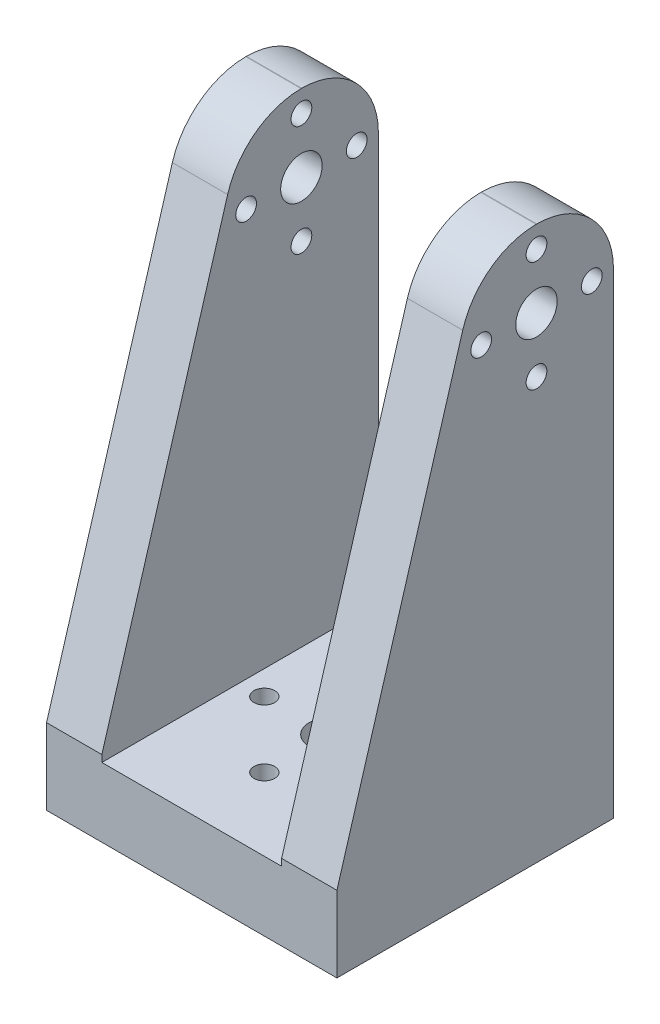
ISO-10303-21;
HEADER;
FILE_DESCRIPTION(('STEP AP214'),'2;1');
FILE_NAME('part.step','',(''),(''),'','','');
FILE_SCHEMA(('AUTOMOTIVE_DESIGN { 1 0 10303 214 1 1 1 1 }'));
ENDSEC;
DATA;
#1=APPLICATION_CONTEXT('core data for automotive mechanical design processes');
#2=APPLICATION_PROTOCOL_DEFINITION('international standard','automotive_design',2000,#1);
#3=PRODUCT_CONTEXT('',#1,'mechanical');
#4=PRODUCT('Part','Part','',(#3));
#5=PRODUCT_RELATED_PRODUCT_CATEGORY('part','',(#4));
#6=PRODUCT_DEFINITION_FORMATION('','',#4);
#7=PRODUCT_DEFINITION_CONTEXT('part definition',#1,'design');
#8=PRODUCT_DEFINITION('design','',#6,#7);
#9=PRODUCT_DEFINITION_SHAPE('','',#8);
#10=(LENGTH_UNIT() NAMED_UNIT(*) SI_UNIT(.MILLI.,.METRE.));
#11=(NAMED_UNIT(*) PLANE_ANGLE_UNIT() SI_UNIT($,.RADIAN.));
#12=(NAMED_UNIT(*) SI_UNIT($,.STERADIAN.) SOLID_ANGLE_UNIT());
#13=UNCERTAINTY_MEASURE_WITH_UNIT(LENGTH_MEASURE(1.E-05),#10,'distance_accuracy_value','');
#14=(GEOMETRIC_REPRESENTATION_CONTEXT(3) GLOBAL_UNCERTAINTY_ASSIGNED_CONTEXT((#13)) GLOBAL_UNIT_ASSIGNED_CONTEXT((#10,
#11,#12)) REPRESENTATION_CONTEXT('',''));
#15=CARTESIAN_POINT('',(0.,0.,0.));
#16=DIRECTION('',(0.,0.,1.));
#17=DIRECTION('',(1.,0.,0.));
#18=AXIS2_PLACEMENT_3D('',#15,#16,#17);
#19=CARTESIAN_POINT('',(-13.,10.,40.));
#20=DIRECTION('',(-1.,0.,0.));
#21=DIRECTION('',(0.,-1.,0.));
#22=AXIS2_PLACEMENT_3D('',#19,#20,#21);
#23=PLANE('',#22);
#24=CARTESIAN_POINT('',(-13.,76.8660020905922,11.1344946143605));
#25=DIRECTION('',(-1.,0.,0.));
#26=DIRECTION('',(0.,-1.,0.));
#27=AXIS2_PLACEMENT_3D('',#24,#25,#26);
#28=CIRCLE('',#27,1.50000000000001);
#29=CARTESIAN_POINT('',(-13.,75.3660020905922,11.1344946143605));
#30=VERTEX_POINT('',#29);
#31=EDGE_CURVE('E331',#30,#30,#28,.T.);
#32=ORIENTED_EDGE('',*,*,#31,.T.);
#33=EDGE_LOOP('',(#32));
#34=FACE_BOUND('',#33,.T.);
#35=CARTESIAN_POINT('',(-13.,68.8660020905922,19.1344946143605));
#36=DIRECTION('',(-1.,0.,0.));
#37=DIRECTION('',(0.,-1.,0.));
#38=AXIS2_PLACEMENT_3D('',#35,#36,#37);
#39=CIRCLE('',#38,1.5);
#40=CARTESIAN_POINT('',(-13.,67.3660020905922,19.1344946143605));
#41=VERTEX_POINT('',#40);
#42=EDGE_CURVE('E318',#41,#41,#39,.T.);
#43=ORIENTED_EDGE('',*,*,#42,.T.);
#44=EDGE_LOOP('',(#43));
#45=FACE_BOUND('',#44,.T.);
#46=CARTESIAN_POINT('',(-13.,60.8660020905922,11.1344946143604));
#47=DIRECTION('',(-1.,0.,0.));
#48=DIRECTION('',(0.,-1.,0.));
#49=AXIS2_PLACEMENT_3D('',#46,#47,#48);
#50=CIRCLE('',#49,1.5);
#51=CARTESIAN_POINT('',(-13.,59.3660020905922,11.1344946143604));
#52=VERTEX_POINT('',#51);
#53=EDGE_CURVE('E314',#52,#52,#50,.T.);
#54=ORIENTED_EDGE('',*,*,#53,.T.);
#55=EDGE_LOOP('',(#54));
#56=FACE_BOUND('',#55,.T.);
#57=CARTESIAN_POINT('',(-13.,68.8660020905922,3.13449461436051));
#58=DIRECTION('',(-1.,0.,0.));
#59=DIRECTION('',(0.,-1.,0.));
#60=AXIS2_PLACEMENT_3D('',#57,#58,#59);
#61=CIRCLE('',#60,1.5);
#62=CARTESIAN_POINT('',(-13.,67.3660020905922,3.13449461436051));
#63=VERTEX_POINT('',#62);
#64=EDGE_CURVE('E310',#63,#63,#61,.T.);
#65=ORIENTED_EDGE('',*,*,#64,.T.);
#66=EDGE_LOOP('',(#65));
#67=FACE_BOUND('',#66,.T.);
#68=CARTESIAN_POINT('',(-13.,68.8660020905922,11.1344946143605));
#69=DIRECTION('',(-1.,0.,0.));
#70=DIRECTION('',(0.,-1.,0.));
#71=AXIS2_PLACEMENT_3D('',#68,#69,#70);
#72=CIRCLE('',#71,3.);
#73=CARTESIAN_POINT('',(-13.,65.8660020905922,11.1344946143605));
#74=VERTEX_POINT('',#73);
#75=EDGE_CURVE('E218',#74,#74,#72,.T.);
#76=ORIENTED_EDGE('',*,*,#75,.T.);
#77=EDGE_LOOP('',(#76));
#78=FACE_BOUND('',#77,.T.);
#79=CARTESIAN_POINT('',(-13.,68.8660020905922,11.1344946143605));
#80=DIRECTION('',(-1.,0.,0.));
#81=DIRECTION('',(0.,-1.,0.));
#82=AXIS2_PLACEMENT_3D('',#79,#80,#81);
#83=CIRCLE('',#82,11.1341050492668);
#84=CARTESIAN_POINT('',(-13.,80.,11.0856499482089));
#85=VERTEX_POINT('',#84);
#86=CARTESIAN_POINT('',(-13.,68.8660020905922,0.000389565093718291));
#87=VERTEX_POINT('',#86);
#88=EDGE_CURVE('E183',#85,#87,#83,.T.);
#89=ORIENTED_EDGE('',*,*,#88,.F.);
#90=DIRECTION('',(0.,0.,-1.));
#91=VECTOR('',#90,1.);
#92=CARTESIAN_POINT('',(-13.,80.,40.));
#93=LINE('',#92,#91);
#94=CARTESIAN_POINT('',(-13.,80.,11.1833392805122));
#95=VERTEX_POINT('',#94);
#96=EDGE_CURVE('E297',#95,#85,#93,.T.);
#97=ORIENTED_EDGE('',*,*,#96,.F.);
#98=CARTESIAN_POINT('',(-13.,68.8660020905922,11.1344946143605));
#99=DIRECTION('',(-1.,0.,0.));
#100=DIRECTION('',(0.,-1.,0.));
#101=AXIS2_PLACEMENT_3D('',#98,#99,#100);
#102=CIRCLE('',#101,11.1341050492668);
#103=CARTESIAN_POINT('',(-13.,72.0457089092662,21.8049097794507));
#104=VERTEX_POINT('',#103);
#105=EDGE_CURVE('E248',#104,#95,#102,.T.);
#106=ORIENTED_EDGE('',*,*,#105,.F.);
#107=DIRECTION('',(0.,-0.958354094727429,0.285582613474929));
#108=VECTOR('',#107,1.);
#109=CARTESIAN_POINT('',(-13.,10.080487600934,40.2700991527157));
#110=LINE('',#109,#108);
#111=CARTESIAN_POINT('',(-13.,10.9868825170594,40.));
#112=VERTEX_POINT('',#111);
#113=EDGE_CURVE('E245',#104,#112,#110,.T.);
#114=ORIENTED_EDGE('',*,*,#113,.T.);
#115=DIRECTION('',(0.,1.,0.));
#116=VECTOR('',#115,1.);
#117=CARTESIAN_POINT('',(-13.,10.,40.));
#118=LINE('',#117,#116);
#119=CARTESIAN_POINT('',(-13.,10.,40.));
#120=VERTEX_POINT('',#119);
#121=EDGE_CURVE('E251',#120,#112,#118,.T.);
#122=ORIENTED_EDGE('',*,*,#121,.F.);
#123=DIRECTION('',(0.,0.,-1.));
#124=VECTOR('',#123,1.);
#125=CARTESIAN_POINT('',(-13.,10.,40.));
#126=LINE('',#125,#124);
#127=CARTESIAN_POINT('',(-13.,10.,0.));
#128=VERTEX_POINT('',#127);
#129=EDGE_CURVE('E266',#120,#128,#126,.T.);
#130=ORIENTED_EDGE('',*,*,#129,.T.);
#131=DIRECTION('',(0.,1.,0.));
#132=VECTOR('',#131,1.);
#133=CARTESIAN_POINT('',(-13.,10.,0.));
#134=LINE('',#133,#132);
#135=CARTESIAN_POINT('',(-13.,10.9868825170594,0.));
#136=VERTEX_POINT('',#135);
#137=EDGE_CURVE('E250',#128,#136,#134,.T.);
#138=ORIENTED_EDGE('',*,*,#137,.T.);
#139=DIRECTION('',(0.,0.999999999977349,6.73066723509058E-06));
#140=VECTOR('',#139,1.);
#141=CARTESIAN_POINT('',(-13.,10.0002692267341,-6.64056575006011E-06));
#142=LINE('',#141,#140);
#143=EDGE_CURVE('E88',#136,#87,#142,.T.);
#144=ORIENTED_EDGE('',*,*,#143,.T.);
#145=EDGE_LOOP('',(#89,#97,#106,#114,#122,#130,#138,#144));
#146=FACE_BOUND('',#145,.T.);
#147=ADVANCED_FACE('F64',(#34,#45,#56,#67,#78,#146),#23,.F.);
#148=CARTESIAN_POINT('',(-13.,80.,40.));
#149=DIRECTION('',(0.,-1.,0.));
#150=DIRECTION('',(0.,0.,-1.));
#151=AXIS2_PLACEMENT_3D('',#148,#149,#150);
#152=PLANE('',#151);
#153=DIRECTION('',(1.,0.,0.));
#154=VECTOR('',#153,1.);
#155=CARTESIAN_POINT('',(-21.,80.,11.0856499482089));
#156=LINE('',#155,#154);
#157=CARTESIAN_POINT('',(-21.,80.,11.0856499482089));
#158=VERTEX_POINT('',#157);
#159=EDGE_CURVE('E208',#158,#85,#156,.T.);
#160=ORIENTED_EDGE('',*,*,#159,.F.);
#161=DIRECTION('',(0.,0.,-1.));
#162=VECTOR('',#161,1.);
#163=CARTESIAN_POINT('',(-21.,80.,40.));
#164=LINE('',#163,#162);
#165=CARTESIAN_POINT('',(-21.,80.,11.1833392805122));
#166=VERTEX_POINT('',#165);
#167=EDGE_CURVE('E197',#166,#158,#164,.T.);
#168=ORIENTED_EDGE('',*,*,#167,.F.);
#169=DIRECTION('',(1.,0.,0.));
#170=VECTOR('',#169,1.);
#171=CARTESIAN_POINT('',(-21.,80.,11.1833392805122));
#172=LINE('',#171,#170);
#173=EDGE_CURVE('E240',#166,#95,#172,.T.);
#174=ORIENTED_EDGE('',*,*,#173,.T.);
#175=ORIENTED_EDGE('',*,*,#96,.T.);
#176=EDGE_LOOP('',(#160,#168,#174,#175));
#177=FACE_BOUND('',#176,.T.);
#178=ADVANCED_FACE('F431',(#177),#152,.F.);
#179=CARTESIAN_POINT('',(-21.,80.,40.));
#180=DIRECTION('',(1.,0.,0.));
#181=DIRECTION('',(0.,0.,-1.));
#182=AXIS2_PLACEMENT_3D('',#179,#180,#181);
#183=PLANE('',#182);
#184=CARTESIAN_POINT('',(-21.,76.8660020905922,11.1344946143605));
#185=DIRECTION('',(-1.,0.,0.));
#186=DIRECTION('',(0.,0.,1.));
#187=AXIS2_PLACEMENT_3D('',#184,#185,#186);
#188=CIRCLE('',#187,1.50000000000001);
#189=CARTESIAN_POINT('',(-21.,76.8660020905922,12.6344946143605));
#190=VERTEX_POINT('',#189);
#191=EDGE_CURVE('E481',#190,#190,#188,.T.);
#192=ORIENTED_EDGE('',*,*,#191,.F.);
#193=EDGE_LOOP('',(#192));
#194=FACE_BOUND('',#193,.T.);
#195=CARTESIAN_POINT('',(-21.,68.8660020905922,19.1344946143605));
#196=DIRECTION('',(-1.,0.,0.));
#197=DIRECTION('',(0.,0.,1.));
#198=AXIS2_PLACEMENT_3D('',#195,#196,#197);
#199=CIRCLE('',#198,1.5);
#200=CARTESIAN_POINT('',(-21.,68.8660020905922,20.6344946143605));
#201=VERTEX_POINT('',#200);
#202=EDGE_CURVE('E485',#201,#201,#199,.T.);
#203=ORIENTED_EDGE('',*,*,#202,.F.);
#204=EDGE_LOOP('',(#203));
#205=FACE_BOUND('',#204,.T.);
#206=CARTESIAN_POINT('',(-21.,60.8660020905922,11.1344946143604));
#207=DIRECTION('',(-1.,0.,0.));
#208=DIRECTION('',(0.,0.,1.));
#209=AXIS2_PLACEMENT_3D('',#206,#207,#208);
#210=CIRCLE('',#209,1.5);
#211=CARTESIAN_POINT('',(-21.,60.8660020905922,12.6344946143604));
#212=VERTEX_POINT('',#211);
#213=EDGE_CURVE('E328',#212,#212,#210,.T.);
#214=ORIENTED_EDGE('',*,*,#213,.F.);
#215=EDGE_LOOP('',(#214));
#216=FACE_BOUND('',#215,.T.);
#217=CARTESIAN_POINT('',(-21.,68.8660020905922,3.13449461436051));
#218=DIRECTION('',(-1.,0.,0.));
#219=DIRECTION('',(0.,0.,1.));
#220=AXIS2_PLACEMENT_3D('',#217,#218,#219);
#221=CIRCLE('',#220,1.5);
#222=CARTESIAN_POINT('',(-21.,68.8660020905922,4.63449461436051));
#223=VERTEX_POINT('',#222);
#224=EDGE_CURVE('E334',#223,#223,#221,.T.);
#225=ORIENTED_EDGE('',*,*,#224,.F.);
#226=EDGE_LOOP('',(#225));
#227=FACE_BOUND('',#226,.T.);
#228=CARTESIAN_POINT('',(-21.,68.8660020905922,11.1344946143605));
#229=DIRECTION('',(1.,0.,0.));
#230=DIRECTION('',(0.,0.,-1.));
#231=AXIS2_PLACEMENT_3D('',#228,#229,#230);
#232=CIRCLE('',#231,3.);
#233=CARTESIAN_POINT('',(-21.,68.8660020905922,8.13449461436051));
#234=VERTEX_POINT('',#233);
#235=EDGE_CURVE('E206',#234,#234,#232,.T.);
#236=ORIENTED_EDGE('',*,*,#235,.T.);
#237=EDGE_LOOP('',(#236));
#238=FACE_BOUND('',#237,.T.);
#239=CARTESIAN_POINT('',(-21.,68.8660020905922,11.1344946143605));
#240=DIRECTION('',(1.,0.,0.));
#241=DIRECTION('',(0.,0.,-1.));
#242=AXIS2_PLACEMENT_3D('',#239,#240,#241);
#243=CIRCLE('',#242,11.1341050492668);
#244=CARTESIAN_POINT('',(-21.,68.8660020905922,0.000389565093718291));
#245=VERTEX_POINT('',#244);
#246=EDGE_CURVE('E180',#245,#158,#243,.T.);
#247=ORIENTED_EDGE('',*,*,#246,.F.);
#248=DIRECTION('',(0.,-0.999999999977349,-6.73066723509058E-06));
#249=VECTOR('',#248,1.);
#250=CARTESIAN_POINT('',(-21.,4.9772644906791E-10,-7.3949050171686E-05));
#251=LINE('',#250,#249);
#252=CARTESIAN_POINT('',(-21.,10.9868825170594,0.));
#253=VERTEX_POINT('',#252);
#254=EDGE_CURVE('E188',#245,#253,#251,.T.);
#255=ORIENTED_EDGE('',*,*,#254,.T.);
#256=DIRECTION('',(0.,-1.,0.));
#257=VECTOR('',#256,1.);
#258=CARTESIAN_POINT('',(-21.,80.,0.));
#259=LINE('',#258,#257);
#260=CARTESIAN_POINT('',(-21.,0.,0.));
#261=VERTEX_POINT('',#260);
#262=EDGE_CURVE('E269',#253,#261,#259,.T.);
#263=ORIENTED_EDGE('',*,*,#262,.T.);
#264=DIRECTION('',(0.,0.,-1.));
#265=VECTOR('',#264,1.);
#266=CARTESIAN_POINT('',(-21.,0.,40.));
#267=LINE('',#266,#265);
#268=CARTESIAN_POINT('',(-21.,0.,40.));
#269=VERTEX_POINT('',#268);
#270=EDGE_CURVE('E293',#269,#261,#267,.T.);
#271=ORIENTED_EDGE('',*,*,#270,.F.);
#272=DIRECTION('',(0.,-1.,0.));
#273=VECTOR('',#272,1.);
#274=CARTESIAN_POINT('',(-21.,80.,40.));
#275=LINE('',#274,#273);
#276=CARTESIAN_POINT('',(-21.,10.9868825170594,40.));
#277=VERTEX_POINT('',#276);
#278=EDGE_CURVE('E254',#277,#269,#275,.T.);
#279=ORIENTED_EDGE('',*,*,#278,.F.);
#280=DIRECTION('',(0.,0.958354094727429,-0.285582613474929));
#281=VECTOR('',#280,1.);
#282=CARTESIAN_POINT('',(-21.,11.8436325723921,39.7446946580154));
#283=LINE('',#282,#281);
#284=CARTESIAN_POINT('',(-21.,72.0457089092662,21.8049097794507));
#285=VERTEX_POINT('',#284);
#286=EDGE_CURVE('E224',#277,#285,#283,.T.);
#287=ORIENTED_EDGE('',*,*,#286,.T.);
#288=CARTESIAN_POINT('',(-21.,68.8660020905922,11.1344946143605));
#289=DIRECTION('',(1.,0.,0.));
#290=DIRECTION('',(0.,0.,-1.));
#291=AXIS2_PLACEMENT_3D('',#288,#289,#290);
#292=CIRCLE('',#291,11.1341050492668);
#293=EDGE_CURVE('E222',#166,#285,#292,.T.);
#294=ORIENTED_EDGE('',*,*,#293,.F.);
#295=ORIENTED_EDGE('',*,*,#167,.T.);
#296=EDGE_LOOP('',(#247,#255,#263,#271,#279,#287,#294,#295));
#297=FACE_BOUND('',#296,.T.);
#298=ADVANCED_FACE('F194',(#194,#205,#216,#227,#238,#297),#183,.F.);
#299=CARTESIAN_POINT('',(21.,80.,40.));
#300=DIRECTION('',(-1.,0.,0.));
#301=DIRECTION('',(0.,0.,1.));
#302=AXIS2_PLACEMENT_3D('',#299,#300,#301);
#303=PLANE('',#302);
#304=CARTESIAN_POINT('',(21.,76.8660020905922,11.1344946143605));
#305=DIRECTION('',(-1.,0.,0.));
#306=DIRECTION('',(0.,0.,1.));
#307=AXIS2_PLACEMENT_3D('',#304,#305,#306);
#308=CIRCLE('',#307,1.50000000000001);
#309=CARTESIAN_POINT('',(21.,76.8660020905922,12.6344946143605));
#310=VERTEX_POINT('',#309);
#311=EDGE_CURVE('E315',#310,#310,#308,.T.);
#312=ORIENTED_EDGE('',*,*,#311,.T.);
#313=EDGE_LOOP('',(#312));
#314=FACE_BOUND('',#313,.T.);
#315=CARTESIAN_POINT('',(21.,68.8660020905922,19.1344946143605));
#316=DIRECTION('',(-1.,0.,0.));
#317=DIRECTION('',(0.,0.,1.));
#318=AXIS2_PLACEMENT_3D('',#315,#316,#317);
#319=CIRCLE('',#318,1.5);
#320=CARTESIAN_POINT('',(21.,68.8660020905922,20.6344946143605));
#321=VERTEX_POINT('',#320);
#322=EDGE_CURVE('E629',#321,#321,#319,.T.);
#323=ORIENTED_EDGE('',*,*,#322,.T.);
#324=EDGE_LOOP('',(#323));
#325=FACE_BOUND('',#324,.T.);
#326=CARTESIAN_POINT('',(21.,60.8660020905922,11.1344946143604));
#327=DIRECTION('',(-1.,0.,0.));
#328=DIRECTION('',(0.,0.,1.));
#329=AXIS2_PLACEMENT_3D('',#326,#327,#328);
#330=CIRCLE('',#329,1.5);
#331=CARTESIAN_POINT('',(21.,60.8660020905922,12.6344946143604));
#332=VERTEX_POINT('',#331);
#333=EDGE_CURVE('E636',#332,#332,#330,.T.);
#334=ORIENTED_EDGE('',*,*,#333,.T.);
#335=EDGE_LOOP('',(#334));
#336=FACE_BOUND('',#335,.T.);
#337=CARTESIAN_POINT('',(21.,68.8660020905922,3.13449461436051));
#338=DIRECTION('',(-1.,0.,0.));
#339=DIRECTION('',(0.,0.,1.));
#340=AXIS2_PLACEMENT_3D('',#337,#338,#339);
#341=CIRCLE('',#340,1.5);
#342=CARTESIAN_POINT('',(21.,68.8660020905922,4.63449461436051));
#343=VERTEX_POINT('',#342);
#344=EDGE_CURVE('E311',#343,#343,#341,.T.);
#345=ORIENTED_EDGE('',*,*,#344,.T.);
#346=EDGE_LOOP('',(#345));
#347=FACE_BOUND('',#346,.T.);
#348=CARTESIAN_POINT('',(21.,68.8660020905922,11.1344946143605));
#349=DIRECTION('',(1.,0.,0.));
#350=DIRECTION('',(0.,0.,-1.));
#351=AXIS2_PLACEMENT_3D('',#348,#349,#350);
#352=CIRCLE('',#351,3.);
#353=CARTESIAN_POINT('',(21.,68.8660020905922,8.13449461436051));
#354=VERTEX_POINT('',#353);
#355=EDGE_CURVE('E202',#354,#354,#352,.T.);
#356=ORIENTED_EDGE('',*,*,#355,.F.);
#357=EDGE_LOOP('',(#356));
#358=FACE_BOUND('',#357,.T.);
#359=CARTESIAN_POINT('',(21.,68.8660020905922,11.1344946143605));
#360=DIRECTION('',(1.,0.,0.));
#361=DIRECTION('',(0.,0.,-1.));
#362=AXIS2_PLACEMENT_3D('',#359,#360,#361);
#363=CIRCLE('',#362,11.1341050492668);
#364=CARTESIAN_POINT('',(21.,68.8660020905922,0.000389565093718291));
#365=VERTEX_POINT('',#364);
#366=CARTESIAN_POINT('',(21.,80.,11.0856499482089));
#367=VERTEX_POINT('',#366);
#368=EDGE_CURVE('E199',#365,#367,#363,.T.);
#369=ORIENTED_EDGE('',*,*,#368,.T.);
#370=DIRECTION('',(0.,0.,-1.));
#371=VECTOR('',#370,1.);
#372=CARTESIAN_POINT('',(21.,80.,40.));
#373=LINE('',#372,#371);
#374=CARTESIAN_POINT('',(21.,80.,11.1833392805122));
#375=VERTEX_POINT('',#374);
#376=EDGE_CURVE('E287',#375,#367,#373,.T.);
#377=ORIENTED_EDGE('',*,*,#376,.F.);
#378=CARTESIAN_POINT('',(21.,68.8660020905922,11.1344946143605));
#379=DIRECTION('',(1.,0.,0.));
#380=DIRECTION('',(0.,0.,-1.));
#381=AXIS2_PLACEMENT_3D('',#378,#379,#380);
#382=CIRCLE('',#381,11.1341050492668);
#383=CARTESIAN_POINT('',(21.,72.0457089092662,21.8049097794507));
#384=VERTEX_POINT('',#383);
#385=EDGE_CURVE('E221',#375,#384,#382,.T.);
#386=ORIENTED_EDGE('',*,*,#385,.T.);
#387=DIRECTION('',(0.,0.958354094727429,-0.285582613474929));
#388=VECTOR('',#387,1.);
#389=CARTESIAN_POINT('',(21.,11.8436325723921,39.7446946580154));
#390=LINE('',#389,#388);
#391=CARTESIAN_POINT('',(21.,10.9868825170594,40.));
#392=VERTEX_POINT('',#391);
#393=EDGE_CURVE('E225',#392,#384,#390,.T.);
#394=ORIENTED_EDGE('',*,*,#393,.F.);
#395=DIRECTION('',(0.,1.,0.));
#396=VECTOR('',#395,1.);
#397=CARTESIAN_POINT('',(21.,80.,40.));
#398=LINE('',#397,#396);
#399=CARTESIAN_POINT('',(21.,0.,40.));
#400=VERTEX_POINT('',#399);
#401=EDGE_CURVE('E259',#400,#392,#398,.T.);
#402=ORIENTED_EDGE('',*,*,#401,.F.);
#403=DIRECTION('',(0.,0.,-1.));
#404=VECTOR('',#403,1.);
#405=CARTESIAN_POINT('',(21.,0.,40.));
#406=LINE('',#405,#404);
#407=CARTESIAN_POINT('',(21.,0.,0.));
#408=VERTEX_POINT('',#407);
#409=EDGE_CURVE('E290',#400,#408,#406,.T.);
#410=ORIENTED_EDGE('',*,*,#409,.T.);
#411=DIRECTION('',(0.,1.,0.));
#412=VECTOR('',#411,1.);
#413=CARTESIAN_POINT('',(21.,80.,0.));
#414=LINE('',#413,#412);
#415=CARTESIAN_POINT('',(21.,10.9868825170594,0.));
#416=VERTEX_POINT('',#415);
#417=EDGE_CURVE('E273',#408,#416,#414,.T.);
#418=ORIENTED_EDGE('',*,*,#417,.T.);
#419=DIRECTION('',(0.,-0.999999999977349,-6.73066723509058E-06));
#420=VECTOR('',#419,1.);
#421=CARTESIAN_POINT('',(21.,4.9772644906791E-10,-7.3949050171686E-05));
#422=LINE('',#421,#420);
#423=EDGE_CURVE('E80',#365,#416,#422,.T.);
#424=ORIENTED_EDGE('',*,*,#423,.F.);
#425=EDGE_LOOP('',(#369,#377,#386,#394,#402,#410,#418,#424));
#426=FACE_BOUND('',#425,.T.);
#427=ADVANCED_FACE('F379',(#314,#325,#336,#347,#358,#426),#303,.F.);
#428=CARTESIAN_POINT('',(13.,80.,40.));
#429=DIRECTION('',(0.,-1.,0.));
#430=DIRECTION('',(0.,0.,-1.));
#431=AXIS2_PLACEMENT_3D('',#428,#429,#430);
#432=PLANE('',#431);
#433=CARTESIAN_POINT('',(13.,80.,11.0856499482089));
#434=VERTEX_POINT('',#433);
#435=EDGE_CURVE('E211',#434,#367,#156,.T.);
#436=ORIENTED_EDGE('',*,*,#435,.F.);
#437=DIRECTION('',(0.,0.,-1.));
#438=VECTOR('',#437,1.);
#439=CARTESIAN_POINT('',(13.,80.,40.));
#440=LINE('',#439,#438);
#441=CARTESIAN_POINT('',(13.,80.,11.1833392805122));
#442=VERTEX_POINT('',#441);
#443=EDGE_CURVE('E284',#442,#434,#440,.T.);
#444=ORIENTED_EDGE('',*,*,#443,.F.);
#445=EDGE_CURVE('E228',#442,#375,#172,.T.);
#446=ORIENTED_EDGE('',*,*,#445,.T.);
#447=ORIENTED_EDGE('',*,*,#376,.T.);
#448=EDGE_LOOP('',(#436,#444,#446,#447));
#449=FACE_BOUND('',#448,.T.);
#450=ADVANCED_FACE('F382',(#449),#432,.F.);
#451=CARTESIAN_POINT('',(13.,10.,40.));
#452=DIRECTION('',(1.,0.,0.));
#453=DIRECTION('',(0.,1.,0.));
#454=AXIS2_PLACEMENT_3D('',#451,#452,#453);
#455=PLANE('',#454);
#456=CARTESIAN_POINT('',(13.,76.8660020905922,11.1344946143605));
#457=DIRECTION('',(1.,0.,0.));
#458=DIRECTION('',(0.,1.,0.));
#459=AXIS2_PLACEMENT_3D('',#456,#457,#458);
#460=CIRCLE('',#459,1.50000000000001);
#461=CARTESIAN_POINT('',(13.,78.3660020905923,11.1344946143605));
#462=VERTEX_POINT('',#461);
#463=EDGE_CURVE('E67',#462,#462,#460,.T.);
#464=ORIENTED_EDGE('',*,*,#463,.T.);
#465=EDGE_LOOP('',(#464));
#466=FACE_BOUND('',#465,.T.);
#467=CARTESIAN_POINT('',(13.,68.8660020905922,19.1344946143605));
#468=DIRECTION('',(1.,0.,0.));
#469=DIRECTION('',(0.,1.,0.));
#470=AXIS2_PLACEMENT_3D('',#467,#468,#469);
#471=CIRCLE('',#470,1.5);
#472=CARTESIAN_POINT('',(13.,70.3660020905922,19.1344946143605));
#473=VERTEX_POINT('',#472);
#474=EDGE_CURVE('E316',#473,#473,#471,.T.);
#475=ORIENTED_EDGE('',*,*,#474,.T.);
#476=EDGE_LOOP('',(#475));
#477=FACE_BOUND('',#476,.T.);
#478=CARTESIAN_POINT('',(13.,60.8660020905922,11.1344946143604));
#479=DIRECTION('',(1.,0.,0.));
#480=DIRECTION('',(0.,1.,0.));
#481=AXIS2_PLACEMENT_3D('',#478,#479,#480);
#482=CIRCLE('',#481,1.5);
#483=CARTESIAN_POINT('',(13.,62.3660020905922,11.1344946143604));
#484=VERTEX_POINT('',#483);
#485=EDGE_CURVE('E312',#484,#484,#482,.T.);
#486=ORIENTED_EDGE('',*,*,#485,.T.);
#487=EDGE_LOOP('',(#486));
#488=FACE_BOUND('',#487,.T.);
#489=CARTESIAN_POINT('',(13.,68.8660020905922,3.13449461436051));
#490=DIRECTION('',(1.,0.,0.));
#491=DIRECTION('',(0.,1.,0.));
#492=AXIS2_PLACEMENT_3D('',#489,#490,#491);
#493=CIRCLE('',#492,1.5);
#494=CARTESIAN_POINT('',(13.,70.3660020905922,3.13449461436051));
#495=VERTEX_POINT('',#494);
#496=EDGE_CURVE('E307',#495,#495,#493,.T.);
#497=ORIENTED_EDGE('',*,*,#496,.T.);
#498=EDGE_LOOP('',(#497));
#499=FACE_BOUND('',#498,.T.);
#500=CARTESIAN_POINT('',(13.,68.8660020905922,11.1344946143605));
#501=DIRECTION('',(1.,0.,0.));
#502=DIRECTION('',(0.,1.,0.));
#503=AXIS2_PLACEMENT_3D('',#500,#501,#502);
#504=CIRCLE('',#503,3.);
#505=CARTESIAN_POINT('',(13.,71.8660020905922,11.1344946143605));
#506=VERTEX_POINT('',#505);
#507=EDGE_CURVE('E217',#506,#506,#504,.T.);
#508=ORIENTED_EDGE('',*,*,#507,.T.);
#509=EDGE_LOOP('',(#508));
#510=FACE_BOUND('',#509,.T.);
#511=CARTESIAN_POINT('',(13.,68.8660020905922,11.1344946143605));
#512=DIRECTION('',(1.,0.,0.));
#513=DIRECTION('',(0.,1.,0.));
#514=AXIS2_PLACEMENT_3D('',#511,#512,#513);
#515=CIRCLE('',#514,11.1341050492668);
#516=CARTESIAN_POINT('',(13.,68.8660020905922,0.000389565093718291));
#517=VERTEX_POINT('',#516);
#518=EDGE_CURVE('E12',#517,#434,#515,.T.);
#519=ORIENTED_EDGE('',*,*,#518,.F.);
#520=DIRECTION('',(0.,-0.999999999977349,-6.73066723509058E-06));
#521=VECTOR('',#520,1.);
#522=CARTESIAN_POINT('',(13.,10.0002692267341,-6.64056575006011E-06));
#523=LINE('',#522,#521);
#524=CARTESIAN_POINT('',(13.,10.9868825170594,0.));
#525=VERTEX_POINT('',#524);
#526=EDGE_CURVE('E210',#517,#525,#523,.T.);
#527=ORIENTED_EDGE('',*,*,#526,.T.);
#528=DIRECTION('',(0.,-1.,0.));
#529=VECTOR('',#528,1.);
#530=CARTESIAN_POINT('',(13.,10.,0.));
#531=LINE('',#530,#529);
#532=CARTESIAN_POINT('',(13.,10.,0.));
#533=VERTEX_POINT('',#532);
#534=EDGE_CURVE('E276',#525,#533,#531,.T.);
#535=ORIENTED_EDGE('',*,*,#534,.T.);
#536=DIRECTION('',(0.,0.,-1.));
#537=VECTOR('',#536,1.);
#538=CARTESIAN_POINT('',(13.,10.,40.));
#539=LINE('',#538,#537);
#540=CARTESIAN_POINT('',(13.,10.,40.));
#541=VERTEX_POINT('',#540);
#542=EDGE_CURVE('E281',#541,#533,#539,.T.);
#543=ORIENTED_EDGE('',*,*,#542,.F.);
#544=DIRECTION('',(0.,-1.,0.));
#545=VECTOR('',#544,1.);
#546=CARTESIAN_POINT('',(13.,10.,40.));
#547=LINE('',#546,#545);
#548=CARTESIAN_POINT('',(13.,10.9868825170594,40.));
#549=VERTEX_POINT('',#548);
#550=EDGE_CURVE('E262',#549,#541,#547,.T.);
#551=ORIENTED_EDGE('',*,*,#550,.F.);
#552=DIRECTION('',(0.,0.958354094727429,-0.285582613474929));
#553=VECTOR('',#552,1.);
#554=CARTESIAN_POINT('',(13.,10.080487600934,40.2700991527157));
#555=LINE('',#554,#553);
#556=CARTESIAN_POINT('',(13.,72.0457089092662,21.8049097794507));
#557=VERTEX_POINT('',#556);
#558=EDGE_CURVE('E236',#549,#557,#555,.T.);
#559=ORIENTED_EDGE('',*,*,#558,.T.);
#560=CARTESIAN_POINT('',(13.,68.8660020905922,11.1344946143605));
#561=DIRECTION('',(1.,0.,0.));
#562=DIRECTION('',(0.,1.,0.));
#563=AXIS2_PLACEMENT_3D('',#560,#561,#562);
#564=CIRCLE('',#563,11.1341050492668);
#565=EDGE_CURVE('E302',#442,#557,#564,.T.);
#566=ORIENTED_EDGE('',*,*,#565,.F.);
#567=ORIENTED_EDGE('',*,*,#443,.T.);
#568=EDGE_LOOP('',(#519,#527,#535,#543,#551,#559,#566,#567));
#569=FACE_BOUND('',#568,.T.);
#570=ADVANCED_FACE('F399',(#466,#477,#488,#499,#510,#569),#455,.F.);
#571=CARTESIAN_POINT('',(-21.,0.,40.));
#572=DIRECTION('',(0.,1.,0.));
#573=DIRECTION('',(0.,0.,1.));
#574=AXIS2_PLACEMENT_3D('',#571,#572,#573);
#575=PLANE('',#574);
#576=CARTESIAN_POINT('',(-9.49999999999986,0.,20.));
#577=DIRECTION('',(0.,1.,0.));
#578=DIRECTION('',(0.,0.,1.));
#579=AXIS2_PLACEMENT_3D('',#576,#577,#578);
#580=CIRCLE('',#579,1.5);
#581=CARTESIAN_POINT('',(-9.49999999999986,0.,21.5));
#582=VERTEX_POINT('',#581);
#583=EDGE_CURVE('E349',#582,#582,#580,.T.);
#584=ORIENTED_EDGE('',*,*,#583,.T.);
#585=EDGE_LOOP('',(#584));
#586=FACE_BOUND('',#585,.T.);
#587=CARTESIAN_POINT('',(2.01463729912353E-13,0.,29.5));
#588=DIRECTION('',(0.,1.,0.));
#589=DIRECTION('',(0.,0.,1.));
#590=AXIS2_PLACEMENT_3D('',#587,#588,#589);
#591=CIRCLE('',#590,1.5);
#592=CARTESIAN_POINT('',(2.01463729912353E-13,0.,31.));
#593=VERTEX_POINT('',#592);
#594=EDGE_CURVE('E342',#593,#593,#591,.T.);
#595=ORIENTED_EDGE('',*,*,#594,.T.);
#596=EDGE_LOOP('',(#595));
#597=FACE_BOUND('',#596,.T.);
#598=CARTESIAN_POINT('',(9.50000000000014,0.,19.9999999999999));
#599=DIRECTION('',(0.,1.,0.));
#600=DIRECTION('',(0.,0.,1.));
#601=AXIS2_PLACEMENT_3D('',#598,#599,#600);
#602=CIRCLE('',#601,1.5);
#603=CARTESIAN_POINT('',(9.50000000000014,0.,21.4999999999999));
#604=VERTEX_POINT('',#603);
#605=EDGE_CURVE('E361',#604,#604,#602,.T.);
#606=ORIENTED_EDGE('',*,*,#605,.T.);
#607=EDGE_LOOP('',(#606));
#608=FACE_BOUND('',#607,.T.);
#609=CARTESIAN_POINT('',(0.,0.,10.5));
#610=DIRECTION('',(0.,1.,0.));
#611=DIRECTION('',(0.,0.,1.));
#612=AXIS2_PLACEMENT_3D('',#609,#610,#611);
#613=CIRCLE('',#612,1.5);
#614=CARTESIAN_POINT('',(0.,0.,12.));
#615=VERTEX_POINT('',#614);
#616=EDGE_CURVE('E354',#615,#615,#613,.T.);
#617=ORIENTED_EDGE('',*,*,#616,.T.);
#618=EDGE_LOOP('',(#617));
#619=FACE_BOUND('',#618,.T.);
#620=CARTESIAN_POINT('',(0.,0.,20.));
#621=DIRECTION('',(0.,1.,0.));
#622=DIRECTION('',(0.,0.,1.));
#623=AXIS2_PLACEMENT_3D('',#620,#621,#622);
#624=CIRCLE('',#623,3.);
#625=CARTESIAN_POINT('',(0.,0.,23.));
#626=VERTEX_POINT('',#625);
#627=EDGE_CURVE('E366',#626,#626,#624,.T.);
#628=ORIENTED_EDGE('',*,*,#627,.T.);
#629=EDGE_LOOP('',(#628));
#630=FACE_BOUND('',#629,.T.);
#631=DIRECTION('',(1.,0.,0.));
#632=VECTOR('',#631,1.);
#633=CARTESIAN_POINT('',(-21.,0.,0.));
#634=LINE('',#633,#632);
#635=EDGE_CURVE('E271',#261,#408,#634,.T.);
#636=ORIENTED_EDGE('',*,*,#635,.T.);
#637=ORIENTED_EDGE('',*,*,#409,.F.);
#638=DIRECTION('',(1.,0.,0.));
#639=VECTOR('',#638,1.);
#640=CARTESIAN_POINT('',(-21.,0.,40.));
#641=LINE('',#640,#639);
#642=EDGE_CURVE('E257',#269,#400,#641,.T.);
#643=ORIENTED_EDGE('',*,*,#642,.F.);
#644=ORIENTED_EDGE('',*,*,#270,.T.);
#645=EDGE_LOOP('',(#636,#637,#643,#644));
#646=FACE_BOUND('',#645,.T.);
#647=ADVANCED_FACE('F458',(#586,#597,#608,#619,#630,#646),#575,.F.);
#648=CARTESIAN_POINT('',(13.,10.,40.));
#649=DIRECTION('',(0.,-1.,0.));
#650=DIRECTION('',(0.,0.,-1.));
#651=AXIS2_PLACEMENT_3D('',#648,#649,#650);
#652=PLANE('',#651);
#653=CARTESIAN_POINT('',(-9.49999999999986,10.,20.));
#654=DIRECTION('',(0.,1.,0.));
#655=DIRECTION('',(0.,0.,1.));
#656=AXIS2_PLACEMENT_3D('',#653,#654,#655);
#657=CIRCLE('',#656,1.5);
#658=CARTESIAN_POINT('',(-9.49999999999986,10.,21.5));
#659=VERTEX_POINT('',#658);
#660=EDGE_CURVE('E341',#659,#659,#657,.T.);
#661=ORIENTED_EDGE('',*,*,#660,.F.);
#662=EDGE_LOOP('',(#661));
#663=FACE_BOUND('',#662,.T.);
#664=CARTESIAN_POINT('',(2.01463729912353E-13,10.,29.5));
#665=DIRECTION('',(0.,1.,0.));
#666=DIRECTION('',(0.,0.,1.));
#667=AXIS2_PLACEMENT_3D('',#664,#665,#666);
#668=CIRCLE('',#667,1.5);
#669=CARTESIAN_POINT('',(2.01463729912353E-13,10.,31.));
#670=VERTEX_POINT('',#669);
#671=EDGE_CURVE('E346',#670,#670,#668,.T.);
#672=ORIENTED_EDGE('',*,*,#671,.F.);
#673=EDGE_LOOP('',(#672));
#674=FACE_BOUND('',#673,.T.);
#675=CARTESIAN_POINT('',(9.50000000000014,10.,19.9999999999999));
#676=DIRECTION('',(0.,1.,0.));
#677=DIRECTION('',(0.,0.,1.));
#678=AXIS2_PLACEMENT_3D('',#675,#676,#677);
#679=CIRCLE('',#678,1.5);
#680=CARTESIAN_POINT('',(9.50000000000014,10.,21.4999999999999));
#681=VERTEX_POINT('',#680);
#682=EDGE_CURVE('E345',#681,#681,#679,.T.);
#683=ORIENTED_EDGE('',*,*,#682,.F.);
#684=EDGE_LOOP('',(#683));
#685=FACE_BOUND('',#684,.T.);
#686=CARTESIAN_POINT('',(0.,10.,10.5));
#687=DIRECTION('',(0.,1.,0.));
#688=DIRECTION('',(0.,0.,1.));
#689=AXIS2_PLACEMENT_3D('',#686,#687,#688);
#690=CIRCLE('',#689,1.5);
#691=CARTESIAN_POINT('',(0.,10.,12.));
#692=VERTEX_POINT('',#691);
#693=EDGE_CURVE('E358',#692,#692,#690,.T.);
#694=ORIENTED_EDGE('',*,*,#693,.F.);
#695=EDGE_LOOP('',(#694));
#696=FACE_BOUND('',#695,.T.);
#697=CARTESIAN_POINT('',(0.,10.,20.));
#698=DIRECTION('',(0.,1.,0.));
#699=DIRECTION('',(0.,0.,1.));
#700=AXIS2_PLACEMENT_3D('',#697,#698,#699);
#701=CIRCLE('',#700,3.);
#702=CARTESIAN_POINT('',(0.,10.,23.));
#703=VERTEX_POINT('',#702);
#704=EDGE_CURVE('E357',#703,#703,#701,.T.);
#705=ORIENTED_EDGE('',*,*,#704,.F.);
#706=EDGE_LOOP('',(#705));
#707=FACE_BOUND('',#706,.T.);
#708=DIRECTION('',(-1.,0.,0.));
#709=VECTOR('',#708,1.);
#710=CARTESIAN_POINT('',(13.,10.,0.));
#711=LINE('',#710,#709);
#712=EDGE_CURVE('E255',#533,#128,#711,.T.);
#713=ORIENTED_EDGE('',*,*,#712,.T.);
#714=ORIENTED_EDGE('',*,*,#129,.F.);
#715=DIRECTION('',(-1.,0.,0.));
#716=VECTOR('',#715,1.);
#717=CARTESIAN_POINT('',(13.,10.,40.));
#718=LINE('',#717,#716);
#719=EDGE_CURVE('E264',#541,#120,#718,.T.);
#720=ORIENTED_EDGE('',*,*,#719,.F.);
#721=ORIENTED_EDGE('',*,*,#542,.T.);
#722=EDGE_LOOP('',(#713,#714,#720,#721));
#723=FACE_BOUND('',#722,.T.);
#724=ADVANCED_FACE('F460',(#663,#674,#685,#696,#707,#723),#652,.F.);
#725=CARTESIAN_POINT('',(0.,0.,40.));
#726=DIRECTION('',(0.,0.,1.));
#727=DIRECTION('',(1.,0.,0.));
#728=AXIS2_PLACEMENT_3D('',#725,#726,#727);
#729=PLANE('',#728);
#730=DIRECTION('',(1.,0.,0.));
#731=VECTOR('',#730,1.);
#732=CARTESIAN_POINT('',(-21.,10.9868825170594,40.));
#733=LINE('',#732,#731);
#734=EDGE_CURVE('E238',#277,#112,#733,.T.);
#735=ORIENTED_EDGE('',*,*,#734,.F.);
#736=ORIENTED_EDGE('',*,*,#278,.T.);
#737=ORIENTED_EDGE('',*,*,#642,.T.);
#738=ORIENTED_EDGE('',*,*,#401,.T.);
#739=DIRECTION('',(1.,0.,0.));
#740=VECTOR('',#739,1.);
#741=CARTESIAN_POINT('',(0.,10.9868825170594,40.));
#742=LINE('',#741,#740);
#743=EDGE_CURVE('E300',#549,#392,#742,.T.);
#744=ORIENTED_EDGE('',*,*,#743,.F.);
#745=ORIENTED_EDGE('',*,*,#550,.T.);
#746=ORIENTED_EDGE('',*,*,#719,.T.);
#747=ORIENTED_EDGE('',*,*,#121,.T.);
#748=EDGE_LOOP('',(#735,#736,#737,#738,#744,#745,#746,#747));
#749=FACE_BOUND('',#748,.T.);
#750=ADVANCED_FACE('F408',(#749),#729,.T.);
#751=CARTESIAN_POINT('',(0.,0.,0.));
#752=DIRECTION('',(0.,0.,1.));
#753=DIRECTION('',(1.,0.,0.));
#754=AXIS2_PLACEMENT_3D('',#751,#752,#753);
#755=PLANE('',#754);
#756=ORIENTED_EDGE('',*,*,#262,.F.);
#757=DIRECTION('',(1.,0.,0.));
#758=VECTOR('',#757,1.);
#759=CARTESIAN_POINT('',(-21.,10.9868825170594,0.));
#760=LINE('',#759,#758);
#761=EDGE_CURVE('E184',#253,#136,#760,.T.);
#762=ORIENTED_EDGE('',*,*,#761,.T.);
#763=ORIENTED_EDGE('',*,*,#137,.F.);
#764=ORIENTED_EDGE('',*,*,#712,.F.);
#765=ORIENTED_EDGE('',*,*,#534,.F.);
#766=DIRECTION('',(1.,0.,0.));
#767=VECTOR('',#766,1.);
#768=CARTESIAN_POINT('',(0.,10.9868825170594,0.));
#769=LINE('',#768,#767);
#770=EDGE_CURVE('E72',#525,#416,#769,.T.);
#771=ORIENTED_EDGE('',*,*,#770,.T.);
#772=ORIENTED_EDGE('',*,*,#417,.F.);
#773=ORIENTED_EDGE('',*,*,#635,.F.);
#774=EDGE_LOOP('',(#756,#762,#763,#764,#765,#771,#772,#773));
#775=FACE_BOUND('',#774,.T.);
#776=ADVANCED_FACE('F416',(#775),#755,.F.);
#777=CARTESIAN_POINT('',(-21.,11.8436325723921,39.7446946580154));
#778=DIRECTION('',(0.,-0.285582613474929,-0.958354094727429));
#779=DIRECTION('',(0.,0.958354094727429,-0.285582613474929));
#780=AXIS2_PLACEMENT_3D('',#777,#778,#779);
#781=PLANE('',#780);
#782=ORIENTED_EDGE('',*,*,#743,.T.);
#783=ORIENTED_EDGE('',*,*,#393,.T.);
#784=DIRECTION('',(1.,0.,0.));
#785=VECTOR('',#784,1.);
#786=CARTESIAN_POINT('',(-21.,72.0457089092662,21.8049097794507));
#787=LINE('',#786,#785);
#788=EDGE_CURVE('E237',#557,#384,#787,.T.);
#789=ORIENTED_EDGE('',*,*,#788,.F.);
#790=ORIENTED_EDGE('',*,*,#558,.F.);
#791=EDGE_LOOP('',(#782,#783,#789,#790));
#792=FACE_BOUND('',#791,.T.);
#793=ADVANCED_FACE('F404',(#792),#781,.F.);
#794=CARTESIAN_POINT('',(-21.,68.8660020905922,11.1344946143605));
#795=DIRECTION('',(1.,0.,0.));
#796=DIRECTION('',(0.,0.,-1.));
#797=AXIS2_PLACEMENT_3D('',#794,#795,#796);
#798=CYLINDRICAL_SURFACE('',#797,11.1341050492668);
#799=ORIENTED_EDGE('',*,*,#565,.T.);
#800=ORIENTED_EDGE('',*,*,#788,.T.);
#801=ORIENTED_EDGE('',*,*,#385,.F.);
#802=ORIENTED_EDGE('',*,*,#445,.F.);
#803=EDGE_LOOP('',(#799,#800,#801,#802));
#804=FACE_BOUND('',#803,.T.);
#805=ADVANCED_FACE('F395',(#804),#798,.T.);
#806=ORIENTED_EDGE('',*,*,#105,.T.);
#807=ORIENTED_EDGE('',*,*,#173,.F.);
#808=ORIENTED_EDGE('',*,*,#293,.T.);
#809=EDGE_CURVE('E233',#285,#104,#787,.T.);
#810=ORIENTED_EDGE('',*,*,#809,.T.);
#811=EDGE_LOOP('',(#806,#807,#808,#810));
#812=FACE_BOUND('',#811,.T.);
#813=ADVANCED_FACE('F448',(#812),#798,.T.);
#814=ORIENTED_EDGE('',*,*,#809,.F.);
#815=ORIENTED_EDGE('',*,*,#286,.F.);
#816=ORIENTED_EDGE('',*,*,#734,.T.);
#817=ORIENTED_EDGE('',*,*,#113,.F.);
#818=EDGE_LOOP('',(#814,#815,#816,#817));
#819=FACE_BOUND('',#818,.T.);
#820=ADVANCED_FACE('F427',(#819),#781,.F.);
#821=CARTESIAN_POINT('',(-21.,4.9772644906791E-10,-7.3949050171686E-05));
#822=DIRECTION('',(0.,-6.73066723509058E-06,0.999999999977349));
#823=DIRECTION('',(0.,-0.999999999977349,-6.73066723509058E-06));
#824=AXIS2_PLACEMENT_3D('',#821,#822,#823);
#825=PLANE('',#824);
#826=DIRECTION('',(1.,0.,0.));
#827=VECTOR('',#826,1.);
#828=CARTESIAN_POINT('',(-21.,68.8660020905922,0.000389565093718291));
#829=LINE('',#828,#827);
#830=EDGE_CURVE('E185',#517,#365,#829,.T.);
#831=ORIENTED_EDGE('',*,*,#830,.T.);
#832=ORIENTED_EDGE('',*,*,#423,.T.);
#833=ORIENTED_EDGE('',*,*,#770,.F.);
#834=ORIENTED_EDGE('',*,*,#526,.F.);
#835=EDGE_LOOP('',(#831,#832,#833,#834));
#836=FACE_BOUND('',#835,.T.);
#837=ADVANCED_FACE('F419',(#836),#825,.F.);
#838=CARTESIAN_POINT('',(-21.,68.8660020905922,11.1344946143605));
#839=DIRECTION('',(1.,0.,0.));
#840=DIRECTION('',(0.,0.,-1.));
#841=AXIS2_PLACEMENT_3D('',#838,#839,#840);
#842=CYLINDRICAL_SURFACE('',#841,11.1341050492668);
#843=ORIENTED_EDGE('',*,*,#518,.T.);
#844=ORIENTED_EDGE('',*,*,#435,.T.);
#845=ORIENTED_EDGE('',*,*,#368,.F.);
#846=ORIENTED_EDGE('',*,*,#830,.F.);
#847=EDGE_LOOP('',(#843,#844,#845,#846));
#848=FACE_BOUND('',#847,.T.);
#849=ADVANCED_FACE('F420',(#848),#842,.T.);
#850=ORIENTED_EDGE('',*,*,#88,.T.);
#851=EDGE_CURVE('E176',#245,#87,#829,.T.);
#852=ORIENTED_EDGE('',*,*,#851,.F.);
#853=ORIENTED_EDGE('',*,*,#246,.T.);
#854=ORIENTED_EDGE('',*,*,#159,.T.);
#855=EDGE_LOOP('',(#850,#852,#853,#854));
#856=FACE_BOUND('',#855,.T.);
#857=ADVANCED_FACE('F178',(#856),#842,.T.);
#858=ORIENTED_EDGE('',*,*,#761,.F.);
#859=ORIENTED_EDGE('',*,*,#254,.F.);
#860=ORIENTED_EDGE('',*,*,#851,.T.);
#861=ORIENTED_EDGE('',*,*,#143,.F.);
#862=EDGE_LOOP('',(#858,#859,#860,#861));
#863=FACE_BOUND('',#862,.T.);
#864=ADVANCED_FACE('F189',(#863),#825,.F.);
#865=CARTESIAN_POINT('',(-21.,68.8660020905922,11.1344946143605));
#866=DIRECTION('',(1.,0.,0.));
#867=DIRECTION('',(0.,0.,-1.));
#868=AXIS2_PLACEMENT_3D('',#865,#866,#867);
#869=CYLINDRICAL_SURFACE('',#868,3.);
#870=ORIENTED_EDGE('',*,*,#355,.T.);
#871=EDGE_LOOP('',(#870));
#872=FACE_BOUND('',#871,.T.);
#873=ORIENTED_EDGE('',*,*,#507,.F.);
#874=EDGE_LOOP('',(#873));
#875=FACE_BOUND('',#874,.T.);
#876=ADVANCED_FACE('F376',(#872,#875),#869,.F.);
#877=ORIENTED_EDGE('',*,*,#235,.F.);
#878=EDGE_LOOP('',(#877));
#879=FACE_BOUND('',#878,.T.);
#880=ORIENTED_EDGE('',*,*,#75,.F.);
#881=EDGE_LOOP('',(#880));
#882=FACE_BOUND('',#881,.T.);
#883=ADVANCED_FACE('F527',(#879,#882),#869,.F.);
#884=CARTESIAN_POINT('',(0.,0.,20.));
#885=DIRECTION('',(0.,1.,0.));
#886=DIRECTION('',(0.,0.,1.));
#887=AXIS2_PLACEMENT_3D('',#884,#885,#886);
#888=CYLINDRICAL_SURFACE('',#887,3.);
#889=ORIENTED_EDGE('',*,*,#627,.F.);
#890=EDGE_LOOP('',(#889));
#891=FACE_BOUND('',#890,.T.);
#892=ORIENTED_EDGE('',*,*,#704,.T.);
#893=EDGE_LOOP('',(#892));
#894=FACE_BOUND('',#893,.T.);
#895=ADVANCED_FACE('F520',(#891,#894),#888,.F.);
#896=CARTESIAN_POINT('',(0.,0.,10.5));
#897=DIRECTION('',(0.,1.,0.));
#898=DIRECTION('',(0.,0.,1.));
#899=AXIS2_PLACEMENT_3D('',#896,#897,#898);
#900=CYLINDRICAL_SURFACE('',#899,1.5);
#901=ORIENTED_EDGE('',*,*,#616,.F.);
#902=EDGE_LOOP('',(#901));
#903=FACE_BOUND('',#902,.T.);
#904=ORIENTED_EDGE('',*,*,#693,.T.);
#905=EDGE_LOOP('',(#904));
#906=FACE_BOUND('',#905,.T.);
#907=ADVANCED_FACE('F517',(#903,#906),#900,.F.);
#908=CARTESIAN_POINT('',(9.50000000000014,0.,19.9999999999999));
#909=DIRECTION('',(0.,1.,0.));
#910=DIRECTION('',(0.,0.,1.));
#911=AXIS2_PLACEMENT_3D('',#908,#909,#910);
#912=CYLINDRICAL_SURFACE('',#911,1.5);
#913=ORIENTED_EDGE('',*,*,#605,.F.);
#914=EDGE_LOOP('',(#913));
#915=FACE_BOUND('',#914,.T.);
#916=ORIENTED_EDGE('',*,*,#682,.T.);
#917=EDGE_LOOP('',(#916));
#918=FACE_BOUND('',#917,.T.);
#919=ADVANCED_FACE('F512',(#915,#918),#912,.F.);
#920=CARTESIAN_POINT('',(2.01463729912353E-13,0.,29.5));
#921=DIRECTION('',(0.,1.,0.));
#922=DIRECTION('',(0.,0.,1.));
#923=AXIS2_PLACEMENT_3D('',#920,#921,#922);
#924=CYLINDRICAL_SURFACE('',#923,1.5);
#925=ORIENTED_EDGE('',*,*,#594,.F.);
#926=EDGE_LOOP('',(#925));
#927=FACE_BOUND('',#926,.T.);
#928=ORIENTED_EDGE('',*,*,#671,.T.);
#929=EDGE_LOOP('',(#928));
#930=FACE_BOUND('',#929,.T.);
#931=ADVANCED_FACE('F509',(#927,#930),#924,.F.);
#932=CARTESIAN_POINT('',(-9.49999999999986,0.,20.));
#933=DIRECTION('',(0.,1.,0.));
#934=DIRECTION('',(0.,0.,1.));
#935=AXIS2_PLACEMENT_3D('',#932,#933,#934);
#936=CYLINDRICAL_SURFACE('',#935,1.5);
#937=ORIENTED_EDGE('',*,*,#583,.F.);
#938=EDGE_LOOP('',(#937));
#939=FACE_BOUND('',#938,.T.);
#940=ORIENTED_EDGE('',*,*,#660,.T.);
#941=EDGE_LOOP('',(#940));
#942=FACE_BOUND('',#941,.T.);
#943=ADVANCED_FACE('F505',(#939,#942),#936,.F.);
#944=CARTESIAN_POINT('',(21.,68.8660020905922,3.13449461436051));
#945=DIRECTION('',(-1.,0.,0.));
#946=DIRECTION('',(0.,0.,1.));
#947=AXIS2_PLACEMENT_3D('',#944,#945,#946);
#948=CYLINDRICAL_SURFACE('',#947,1.5);
#949=ORIENTED_EDGE('',*,*,#344,.F.);
#950=EDGE_LOOP('',(#949));
#951=FACE_BOUND('',#950,.T.);
#952=ORIENTED_EDGE('',*,*,#496,.F.);
#953=EDGE_LOOP('',(#952));
#954=FACE_BOUND('',#953,.T.);
#955=ADVANCED_FACE('F495',(#951,#954),#948,.F.);
#956=ORIENTED_EDGE('',*,*,#224,.T.);
#957=EDGE_LOOP('',(#956));
#958=FACE_BOUND('',#957,.T.);
#959=ORIENTED_EDGE('',*,*,#64,.F.);
#960=EDGE_LOOP('',(#959));
#961=FACE_BOUND('',#960,.T.);
#962=ADVANCED_FACE('F491',(#958,#961),#948,.F.);
#963=CARTESIAN_POINT('',(21.,60.8660020905922,11.1344946143604));
#964=DIRECTION('',(-1.,0.,0.));
#965=DIRECTION('',(0.,0.,1.));
#966=AXIS2_PLACEMENT_3D('',#963,#964,#965);
#967=CYLINDRICAL_SURFACE('',#966,1.5);
#968=ORIENTED_EDGE('',*,*,#333,.F.);
#969=EDGE_LOOP('',(#968));
#970=FACE_BOUND('',#969,.T.);
#971=ORIENTED_EDGE('',*,*,#485,.F.);
#972=EDGE_LOOP('',(#971));
#973=FACE_BOUND('',#972,.T.);
#974=ADVANCED_FACE('F494',(#970,#973),#967,.F.);
#975=CARTESIAN_POINT('',(21.,68.8660020905922,19.1344946143605));
#976=DIRECTION('',(-1.,0.,0.));
#977=DIRECTION('',(0.,0.,1.));
#978=AXIS2_PLACEMENT_3D('',#975,#976,#977);
#979=CYLINDRICAL_SURFACE('',#978,1.5);
#980=ORIENTED_EDGE('',*,*,#322,.F.);
#981=EDGE_LOOP('',(#980));
#982=FACE_BOUND('',#981,.T.);
#983=ORIENTED_EDGE('',*,*,#474,.F.);
#984=EDGE_LOOP('',(#983));
#985=FACE_BOUND('',#984,.T.);
#986=ADVANCED_FACE('F501',(#982,#985),#979,.F.);
#987=CARTESIAN_POINT('',(21.,76.8660020905922,11.1344946143605));
#988=DIRECTION('',(-1.,0.,0.));
#989=DIRECTION('',(0.,0.,1.));
#990=AXIS2_PLACEMENT_3D('',#987,#988,#989);
#991=CYLINDRICAL_SURFACE('',#990,1.50000000000001);
#992=ORIENTED_EDGE('',*,*,#311,.F.);
#993=EDGE_LOOP('',(#992));
#994=FACE_BOUND('',#993,.T.);
#995=ORIENTED_EDGE('',*,*,#463,.F.);
#996=EDGE_LOOP('',(#995));
#997=FACE_BOUND('',#996,.T.);
#998=ADVANCED_FACE('F589',(#994,#997),#991,.F.);
#999=ORIENTED_EDGE('',*,*,#213,.T.);
#1000=EDGE_LOOP('',(#999));
#1001=FACE_BOUND('',#1000,.T.);
#1002=ORIENTED_EDGE('',*,*,#53,.F.);
#1003=EDGE_LOOP('',(#1002));
#1004=FACE_BOUND('',#1003,.T.);
#1005=ADVANCED_FACE('F504',(#1001,#1004),#967,.F.);
#1006=ORIENTED_EDGE('',*,*,#202,.T.);
#1007=EDGE_LOOP('',(#1006));
#1008=FACE_BOUND('',#1007,.T.);
#1009=ORIENTED_EDGE('',*,*,#42,.F.);
#1010=EDGE_LOOP('',(#1009));
#1011=FACE_BOUND('',#1010,.T.);
#1012=ADVANCED_FACE('F591',(#1008,#1011),#979,.F.);
#1013=ORIENTED_EDGE('',*,*,#191,.T.);
#1014=EDGE_LOOP('',(#1013));
#1015=FACE_BOUND('',#1014,.T.);
#1016=ORIENTED_EDGE('',*,*,#31,.F.);
#1017=EDGE_LOOP('',(#1016));
#1018=FACE_BOUND('',#1017,.T.);
#1019=ADVANCED_FACE('F601',(#1015,#1018),#991,.F.);
#1020=CLOSED_SHELL('',(#147,#178,#298,#427,#450,#570,#647,#724,#750,#776,#793,#805,#813,#820,
#837,#849,#857,#864,#876,#883,#895,#907,#919,#931,#943,#955,#962,#974,#986,#998,#1005,#1012,#1019));
#1021=MANIFOLD_SOLID_BREP('B2',#1020);
#1022=ADVANCED_BREP_SHAPE_REPRESENTATION('',(#18,#1021),#14);
#1023=SHAPE_DEFINITION_REPRESENTATION(#9,#1022);
ENDSEC;
END-ISO-10303-21;
